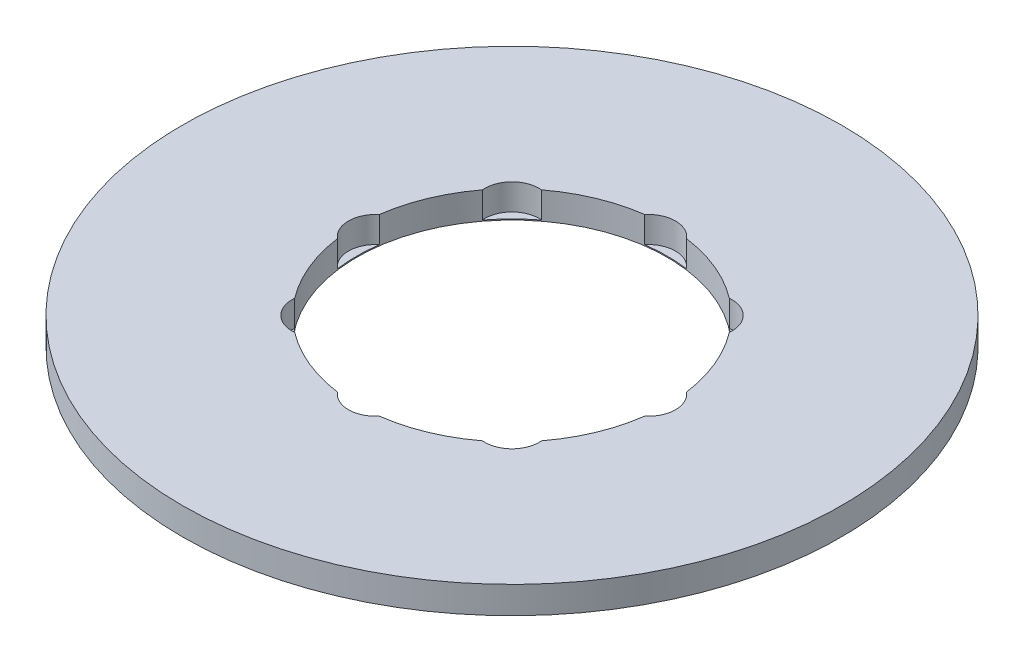
ISO-10303-21;
HEADER;
FILE_DESCRIPTION(('STEP AP214'),'2;1');
FILE_NAME('part.step','',(''),(''),'','','');
FILE_SCHEMA(('AUTOMOTIVE_DESIGN { 1 0 10303 214 1 1 1 1 }'));
ENDSEC;
DATA;
#1=APPLICATION_CONTEXT('core data for automotive mechanical design processes');
#2=APPLICATION_PROTOCOL_DEFINITION('international standard','automotive_design',2000,#1);
#3=PRODUCT_CONTEXT('',#1,'mechanical');
#4=PRODUCT('Part','Part','',(#3));
#5=PRODUCT_RELATED_PRODUCT_CATEGORY('part','',(#4));
#6=PRODUCT_DEFINITION_FORMATION('','',#4);
#7=PRODUCT_DEFINITION_CONTEXT('part definition',#1,'design');
#8=PRODUCT_DEFINITION('design','',#6,#7);
#9=PRODUCT_DEFINITION_SHAPE('','',#8);
#10=(LENGTH_UNIT() NAMED_UNIT(*) SI_UNIT(.MILLI.,.METRE.));
#11=(NAMED_UNIT(*) PLANE_ANGLE_UNIT() SI_UNIT($,.RADIAN.));
#12=(NAMED_UNIT(*) SI_UNIT($,.STERADIAN.) SOLID_ANGLE_UNIT());
#13=UNCERTAINTY_MEASURE_WITH_UNIT(LENGTH_MEASURE(1.E-05),#10,'distance_accuracy_value','');
#14=(GEOMETRIC_REPRESENTATION_CONTEXT(3) GLOBAL_UNCERTAINTY_ASSIGNED_CONTEXT((#13)) GLOBAL_UNIT_ASSIGNED_CONTEXT((#10,
#11,#12)) REPRESENTATION_CONTEXT('',''));
#15=CARTESIAN_POINT('',(0.,0.,0.));
#16=DIRECTION('',(0.,0.,1.));
#17=DIRECTION('',(1.,0.,0.));
#18=AXIS2_PLACEMENT_3D('',#15,#16,#17);
#19=CARTESIAN_POINT('',(0.,7.,0.));
#20=DIRECTION('',(0.,-1.,0.));
#21=DIRECTION('',(0.,0.,-1.));
#22=AXIS2_PLACEMENT_3D('',#19,#20,#21);
#23=CYLINDRICAL_SURFACE('',#22,85.);
#24=CARTESIAN_POINT('',(0.,7.,0.));
#25=DIRECTION('',(0.,1.,0.));
#26=DIRECTION('',(0.,0.,1.));
#27=AXIS2_PLACEMENT_3D('',#24,#25,#26);
#28=CIRCLE('',#27,85.);
#29=CARTESIAN_POINT('',(0.,7.,85.));
#30=VERTEX_POINT('',#29);
#31=EDGE_CURVE('E183',#30,#30,#28,.T.);
#32=ORIENTED_EDGE('',*,*,#31,.F.);
#33=EDGE_LOOP('',(#32));
#34=FACE_BOUND('',#33,.T.);
#35=CARTESIAN_POINT('',(0.,0.,0.));
#36=DIRECTION('',(0.,1.,0.));
#37=DIRECTION('',(0.,0.,1.));
#38=AXIS2_PLACEMENT_3D('',#35,#36,#37);
#39=CIRCLE('',#38,85.);
#40=CARTESIAN_POINT('',(0.,0.,85.));
#41=VERTEX_POINT('',#40);
#42=EDGE_CURVE('E182',#41,#41,#39,.T.);
#43=ORIENTED_EDGE('',*,*,#42,.T.);
#44=EDGE_LOOP('',(#43));
#45=FACE_BOUND('',#44,.T.);
#46=ADVANCED_FACE('F39',(#34,#45),#23,.T.);
#47=CARTESIAN_POINT('',(0.,7.,0.));
#48=DIRECTION('',(0.,1.,0.));
#49=DIRECTION('',(0.,0.,1.));
#50=AXIS2_PLACEMENT_3D('',#47,#48,#49);
#51=PLANE('',#50);
#52=CARTESIAN_POINT('',(1.22781829028546E-13,7.,35.166113495319));
#53=DIRECTION('',(0.,1.,0.));
#54=DIRECTION('',(1.,0.,0.));
#55=AXIS2_PLACEMENT_3D('',#52,#53,#54);
#56=CIRCLE('',#55,7.00584314260088);
#57=CARTESIAN_POINT('',(-5.39597048317015,7.,39.6343727406497));
#58=VERTEX_POINT('',#57);
#59=CARTESIAN_POINT('',(5.39597048317043,7.,39.6343727406497));
#60=VERTEX_POINT('',#59);
#61=EDGE_CURVE('E256',#58,#60,#56,.T.);
#62=ORIENTED_EDGE('',*,*,#61,.F.);
#63=CARTESIAN_POINT('',(0.,7.,0.));
#64=DIRECTION('',(0.,1.,0.));
#65=DIRECTION('',(0.,0.,1.));
#66=AXIS2_PLACEMENT_3D('',#63,#64,#65);
#67=CIRCLE('',#66,40.);
#68=CARTESIAN_POINT('',(-24.2102064132564,7.,31.8412610527209));
#69=VERTEX_POINT('',#68);
#70=EDGE_CURVE('E175',#69,#58,#67,.T.);
#71=ORIENTED_EDGE('',*,*,#70,.F.);
#72=CARTESIAN_POINT('',(-24.8661973205158,7.,24.8661973205159));
#73=DIRECTION('',(0.,1.,0.));
#74=DIRECTION('',(0.707106781186549,0.,0.707106781186546));
#75=AXIS2_PLACEMENT_3D('',#72,#73,#74);
#76=CIRCLE('',#75,7.00584314260088);
#77=CARTESIAN_POINT('',(-31.8412610527208,7.,24.2102064132565));
#78=VERTEX_POINT('',#77);
#79=EDGE_CURVE('E152',#78,#69,#76,.T.);
#80=ORIENTED_EDGE('',*,*,#79,.F.);
#81=CARTESIAN_POINT('',(-39.6343727406497,7.,5.39597048317029));
#82=VERTEX_POINT('',#81);
#83=EDGE_CURVE('E168',#82,#78,#67,.T.);
#84=ORIENTED_EDGE('',*,*,#83,.F.);
#85=CARTESIAN_POINT('',(-35.166113495319,7.,0.));
#86=DIRECTION('',(0.,1.,0.));
#87=DIRECTION('',(0.,0.,1.));
#88=AXIS2_PLACEMENT_3D('',#85,#86,#87);
#89=CIRCLE('',#88,7.00584314260088);
#90=CARTESIAN_POINT('',(-39.6343727406497,7.,-5.39597048317029));
#91=VERTEX_POINT('',#90);
#92=EDGE_CURVE('E205',#91,#82,#89,.T.);
#93=ORIENTED_EDGE('',*,*,#92,.F.);
#94=CARTESIAN_POINT('',(-31.8412610527211,7.,-24.2102064132561));
#95=VERTEX_POINT('',#94);
#96=EDGE_CURVE('E181',#95,#91,#67,.T.);
#97=ORIENTED_EDGE('',*,*,#96,.F.);
#98=CARTESIAN_POINT('',(-24.8661973205162,7.,-24.8661973205156));
#99=DIRECTION('',(0.,1.,0.));
#100=DIRECTION('',(-0.707106781186539,0.,0.707106781186556));
#101=AXIS2_PLACEMENT_3D('',#98,#99,#100);
#102=CIRCLE('',#101,7.00584314260088);
#103=CARTESIAN_POINT('',(-24.2102064132569,7.,-31.8412610527205));
#104=VERTEX_POINT('',#103);
#105=EDGE_CURVE('E453',#104,#95,#102,.T.);
#106=ORIENTED_EDGE('',*,*,#105,.F.);
#107=CARTESIAN_POINT('',(-5.3959704831707,7.,-39.6343727406496));
#108=VERTEX_POINT('',#107);
#109=EDGE_CURVE('E189',#108,#104,#67,.T.);
#110=ORIENTED_EDGE('',*,*,#109,.F.);
#111=CARTESIAN_POINT('',(-3.68345487085638E-13,7.,-35.166113495319));
#112=DIRECTION('',(0.,1.,0.));
#113=DIRECTION('',(-1.,0.,0.));
#114=AXIS2_PLACEMENT_3D('',#111,#112,#113);
#115=CIRCLE('',#114,7.00584314260088);
#116=CARTESIAN_POINT('',(5.39597048316987,7.,-39.6343727406497));
#117=VERTEX_POINT('',#116);
#118=EDGE_CURVE('E462',#117,#108,#115,.T.);
#119=ORIENTED_EDGE('',*,*,#118,.F.);
#120=CARTESIAN_POINT('',(24.2102064132562,7.,-31.841261052721));
#121=VERTEX_POINT('',#120);
#122=EDGE_CURVE('E197',#121,#117,#67,.T.);
#123=ORIENTED_EDGE('',*,*,#122,.F.);
#124=CARTESIAN_POINT('',(24.8661973205156,7.,-24.8661973205161));
#125=DIRECTION('',(0.,1.,0.));
#126=DIRECTION('',(-0.707106781186554,0.,-0.707106781186541));
#127=AXIS2_PLACEMENT_3D('',#124,#125,#126);
#128=CIRCLE('',#127,7.00584314260088);
#129=CARTESIAN_POINT('',(31.8412610527206,7.,-24.2102064132568));
#130=VERTEX_POINT('',#129);
#131=EDGE_CURVE('E470',#130,#121,#128,.T.);
#132=ORIENTED_EDGE('',*,*,#131,.F.);
#133=CARTESIAN_POINT('',(39.6343727406497,7.,-5.39597048317029));
#134=VERTEX_POINT('',#133);
#135=EDGE_CURVE('E489',#134,#130,#67,.T.);
#136=ORIENTED_EDGE('',*,*,#135,.F.);
#137=CARTESIAN_POINT('',(35.166113495319,7.,0.));
#138=DIRECTION('',(0.,1.,0.));
#139=DIRECTION('',(0.,0.,-1.));
#140=AXIS2_PLACEMENT_3D('',#137,#138,#139);
#141=CIRCLE('',#140,7.00584314260088);
#142=CARTESIAN_POINT('',(39.6343727406497,7.,5.39597048317029));
#143=VERTEX_POINT('',#142);
#144=EDGE_CURVE('E476',#143,#134,#141,.T.);
#145=ORIENTED_EDGE('',*,*,#144,.F.);
#146=CARTESIAN_POINT('',(31.8412610527209,7.,24.2102064132563));
#147=VERTEX_POINT('',#146);
#148=EDGE_CURVE('E491',#147,#143,#67,.T.);
#149=ORIENTED_EDGE('',*,*,#148,.F.);
#150=CARTESIAN_POINT('',(24.866197320516,7.,24.8661973205157));
#151=DIRECTION('',(0.,1.,0.));
#152=DIRECTION('',(0.707106781186544,0.,-0.707106781186551));
#153=AXIS2_PLACEMENT_3D('',#150,#151,#152);
#154=CIRCLE('',#153,7.00584314260088);
#155=CARTESIAN_POINT('',(24.2102064132566,7.,31.8412610527207));
#156=VERTEX_POINT('',#155);
#157=EDGE_CURVE('E475',#156,#147,#154,.T.);
#158=ORIENTED_EDGE('',*,*,#157,.F.);
#159=EDGE_CURVE('E190',#60,#156,#67,.T.);
#160=ORIENTED_EDGE('',*,*,#159,.F.);
#161=EDGE_LOOP('',(#62,#71,#80,#84,#93,#97,#106,#110,#119,#123,#132,#136,#145,#149,#158,#160));
#162=FACE_BOUND('',#161,.T.);
#163=ORIENTED_EDGE('',*,*,#31,.T.);
#164=EDGE_LOOP('',(#163));
#165=FACE_BOUND('',#164,.T.);
#166=ADVANCED_FACE('F170',(#162,#165),#51,.T.);
#167=CARTESIAN_POINT('',(0.,0.,0.));
#168=DIRECTION('',(0.,1.,0.));
#169=DIRECTION('',(0.,0.,1.));
#170=AXIS2_PLACEMENT_3D('',#167,#168,#169);
#171=PLANE('',#170);
#172=CARTESIAN_POINT('',(0.,0.,0.));
#173=DIRECTION('',(0.,1.,0.));
#174=DIRECTION('',(0.,0.,1.));
#175=AXIS2_PLACEMENT_3D('',#172,#173,#174);
#176=CIRCLE('',#175,40.);
#177=CARTESIAN_POINT('',(0.,0.,40.));
#178=VERTEX_POINT('',#177);
#179=EDGE_CURVE('E191',#178,#178,#176,.T.);
#180=ORIENTED_EDGE('',*,*,#179,.T.);
#181=EDGE_LOOP('',(#180));
#182=FACE_BOUND('',#181,.T.);
#183=ORIENTED_EDGE('',*,*,#42,.F.);
#184=EDGE_LOOP('',(#183));
#185=FACE_BOUND('',#184,.T.);
#186=ADVANCED_FACE('F277',(#182,#185),#171,.F.);
#187=CARTESIAN_POINT('',(0.,7.,0.));
#188=DIRECTION('',(0.,-1.,0.));
#189=DIRECTION('',(0.,0.,-1.));
#190=AXIS2_PLACEMENT_3D('',#187,#188,#189);
#191=CYLINDRICAL_SURFACE('',#190,40.);
#192=DIRECTION('',(0.,1.,0.));
#193=VECTOR('',#192,1.);
#194=CARTESIAN_POINT('',(-5.39597048317015,3.63539251984603,39.6343727406497));
#195=LINE('',#194,#193);
#196=CARTESIAN_POINT('',(-5.39597048317015,0.270785039692067,39.6343727406497));
#197=VERTEX_POINT('',#196);
#198=EDGE_CURVE('E11',#197,#58,#195,.T.);
#199=ORIENTED_EDGE('',*,*,#198,.F.);
#200=CARTESIAN_POINT('',(0.,0.270785039692067,0.));
#201=DIRECTION('',(0.,1.,0.));
#202=DIRECTION('',(0.,0.,1.));
#203=AXIS2_PLACEMENT_3D('',#200,#201,#202);
#204=CIRCLE('',#203,40.);
#205=CARTESIAN_POINT('',(5.39597048317043,0.270785039692067,39.6343727406497));
#206=VERTEX_POINT('',#205);
#207=EDGE_CURVE('E251',#197,#206,#204,.T.);
#208=ORIENTED_EDGE('',*,*,#207,.T.);
#209=DIRECTION('',(0.,1.,0.));
#210=VECTOR('',#209,1.);
#211=CARTESIAN_POINT('',(5.39597048317043,3.63539251984603,39.6343727406497));
#212=LINE('',#211,#210);
#213=EDGE_CURVE('E46',#60,#206,#212,.F.);
#214=ORIENTED_EDGE('',*,*,#213,.F.);
#215=ORIENTED_EDGE('',*,*,#159,.T.);
#216=DIRECTION('',(0.,1.,0.));
#217=VECTOR('',#216,1.);
#218=CARTESIAN_POINT('',(24.2102064132566,3.63539251984603,31.8412610527207));
#219=LINE('',#218,#217);
#220=CARTESIAN_POINT('',(24.2102064132566,0.270785039692067,31.8412610527207));
#221=VERTEX_POINT('',#220);
#222=EDGE_CURVE('E253',#221,#156,#219,.T.);
#223=ORIENTED_EDGE('',*,*,#222,.F.);
#224=CARTESIAN_POINT('',(0.,0.270785039692067,0.));
#225=DIRECTION('',(0.,1.,0.));
#226=DIRECTION('',(0.,0.,1.));
#227=AXIS2_PLACEMENT_3D('',#224,#225,#226);
#228=CIRCLE('',#227,40.);
#229=CARTESIAN_POINT('',(31.8412610527209,0.270785039692067,24.2102064132563));
#230=VERTEX_POINT('',#229);
#231=EDGE_CURVE('E246',#221,#230,#228,.T.);
#232=ORIENTED_EDGE('',*,*,#231,.T.);
#233=DIRECTION('',(0.,1.,0.));
#234=VECTOR('',#233,1.);
#235=CARTESIAN_POINT('',(31.8412610527209,3.63539251984603,24.2102064132563));
#236=LINE('',#235,#234);
#237=EDGE_CURVE('E248',#147,#230,#236,.F.);
#238=ORIENTED_EDGE('',*,*,#237,.F.);
#239=ORIENTED_EDGE('',*,*,#148,.T.);
#240=DIRECTION('',(0.,1.,0.));
#241=VECTOR('',#240,1.);
#242=CARTESIAN_POINT('',(39.6343727406497,3.63539251984603,5.39597048317029));
#243=LINE('',#242,#241);
#244=CARTESIAN_POINT('',(39.6343727406497,0.270785039692067,5.39597048317029));
#245=VERTEX_POINT('',#244);
#246=EDGE_CURVE('E243',#245,#143,#243,.T.);
#247=ORIENTED_EDGE('',*,*,#246,.F.);
#248=CARTESIAN_POINT('',(0.,0.270785039692067,0.));
#249=DIRECTION('',(0.,1.,0.));
#250=DIRECTION('',(0.,0.,1.));
#251=AXIS2_PLACEMENT_3D('',#248,#249,#250);
#252=CIRCLE('',#251,40.);
#253=CARTESIAN_POINT('',(39.6343727406497,0.270785039692067,-5.39597048317029));
#254=VERTEX_POINT('',#253);
#255=EDGE_CURVE('E236',#245,#254,#252,.T.);
#256=ORIENTED_EDGE('',*,*,#255,.T.);
#257=DIRECTION('',(0.,1.,0.));
#258=VECTOR('',#257,1.);
#259=CARTESIAN_POINT('',(39.6343727406497,3.63539251984603,-5.39597048317029));
#260=LINE('',#259,#258);
#261=EDGE_CURVE('E241',#134,#254,#260,.F.);
#262=ORIENTED_EDGE('',*,*,#261,.F.);
#263=ORIENTED_EDGE('',*,*,#135,.T.);
#264=DIRECTION('',(0.,1.,0.));
#265=VECTOR('',#264,1.);
#266=CARTESIAN_POINT('',(31.8412610527206,3.63539251984603,-24.2102064132568));
#267=LINE('',#266,#265);
#268=CARTESIAN_POINT('',(31.8412610527206,0.270785039692067,-24.2102064132568));
#269=VERTEX_POINT('',#268);
#270=EDGE_CURVE('E237',#269,#130,#267,.T.);
#271=ORIENTED_EDGE('',*,*,#270,.F.);
#272=CARTESIAN_POINT('',(0.,0.270785039692067,0.));
#273=DIRECTION('',(0.,1.,0.));
#274=DIRECTION('',(0.,0.,1.));
#275=AXIS2_PLACEMENT_3D('',#272,#273,#274);
#276=CIRCLE('',#275,40.);
#277=CARTESIAN_POINT('',(24.2102064132562,0.270785039692067,-31.841261052721));
#278=VERTEX_POINT('',#277);
#279=EDGE_CURVE('E229',#269,#278,#276,.T.);
#280=ORIENTED_EDGE('',*,*,#279,.T.);
#281=DIRECTION('',(0.,1.,0.));
#282=VECTOR('',#281,1.);
#283=CARTESIAN_POINT('',(24.2102064132562,3.63539251984603,-31.841261052721));
#284=LINE('',#283,#282);
#285=EDGE_CURVE('E232',#121,#278,#284,.F.);
#286=ORIENTED_EDGE('',*,*,#285,.F.);
#287=ORIENTED_EDGE('',*,*,#122,.T.);
#288=DIRECTION('',(0.,1.,0.));
#289=VECTOR('',#288,1.);
#290=CARTESIAN_POINT('',(5.39597048316987,3.63539251984603,-39.6343727406497));
#291=LINE('',#290,#289);
#292=CARTESIAN_POINT('',(5.39597048316987,0.270785039692067,-39.6343727406497));
#293=VERTEX_POINT('',#292);
#294=EDGE_CURVE('E227',#293,#117,#291,.T.);
#295=ORIENTED_EDGE('',*,*,#294,.F.);
#296=CARTESIAN_POINT('',(0.,0.270785039692067,0.));
#297=DIRECTION('',(0.,1.,0.));
#298=DIRECTION('',(0.,0.,1.));
#299=AXIS2_PLACEMENT_3D('',#296,#297,#298);
#300=CIRCLE('',#299,40.);
#301=CARTESIAN_POINT('',(-5.3959704831707,0.270785039692067,-39.6343727406496));
#302=VERTEX_POINT('',#301);
#303=EDGE_CURVE('E225',#293,#302,#300,.T.);
#304=ORIENTED_EDGE('',*,*,#303,.T.);
#305=DIRECTION('',(0.,1.,0.));
#306=VECTOR('',#305,1.);
#307=CARTESIAN_POINT('',(-5.3959704831707,3.63539251984603,-39.6343727406496));
#308=LINE('',#307,#306);
#309=EDGE_CURVE('E223',#108,#302,#308,.F.);
#310=ORIENTED_EDGE('',*,*,#309,.F.);
#311=ORIENTED_EDGE('',*,*,#109,.T.);
#312=DIRECTION('',(0.,1.,0.));
#313=VECTOR('',#312,1.);
#314=CARTESIAN_POINT('',(-24.2102064132569,3.63539251984603,-31.8412610527205));
#315=LINE('',#314,#313);
#316=CARTESIAN_POINT('',(-24.2102064132569,0.270785039692067,-31.8412610527205));
#317=VERTEX_POINT('',#316);
#318=EDGE_CURVE('E219',#317,#104,#315,.T.);
#319=ORIENTED_EDGE('',*,*,#318,.F.);
#320=CARTESIAN_POINT('',(0.,0.270785039692067,0.));
#321=DIRECTION('',(0.,1.,0.));
#322=DIRECTION('',(0.,0.,1.));
#323=AXIS2_PLACEMENT_3D('',#320,#321,#322);
#324=CIRCLE('',#323,40.);
#325=CARTESIAN_POINT('',(-31.8412610527211,0.270785039692067,-24.2102064132561));
#326=VERTEX_POINT('',#325);
#327=EDGE_CURVE('E159',#317,#326,#324,.T.);
#328=ORIENTED_EDGE('',*,*,#327,.T.);
#329=DIRECTION('',(0.,1.,0.));
#330=VECTOR('',#329,1.);
#331=CARTESIAN_POINT('',(-31.8412610527211,3.63539251984603,-24.2102064132561));
#332=LINE('',#331,#330);
#333=EDGE_CURVE('E220',#95,#326,#332,.F.);
#334=ORIENTED_EDGE('',*,*,#333,.F.);
#335=ORIENTED_EDGE('',*,*,#96,.T.);
#336=DIRECTION('',(0.,1.,0.));
#337=VECTOR('',#336,1.);
#338=CARTESIAN_POINT('',(-39.6343727406497,3.63539251984603,-5.39597048317029));
#339=LINE('',#338,#337);
#340=CARTESIAN_POINT('',(-39.6343727406497,0.270785039692067,-5.39597048317029));
#341=VERTEX_POINT('',#340);
#342=EDGE_CURVE('E209',#341,#91,#339,.T.);
#343=ORIENTED_EDGE('',*,*,#342,.F.);
#344=CARTESIAN_POINT('',(0.,0.270785039692067,0.));
#345=DIRECTION('',(0.,1.,0.));
#346=DIRECTION('',(0.,0.,1.));
#347=AXIS2_PLACEMENT_3D('',#344,#345,#346);
#348=CIRCLE('',#347,40.);
#349=CARTESIAN_POINT('',(-39.6343727406497,0.270785039692067,5.39597048317029));
#350=VERTEX_POINT('',#349);
#351=EDGE_CURVE('E206',#341,#350,#348,.T.);
#352=ORIENTED_EDGE('',*,*,#351,.T.);
#353=DIRECTION('',(0.,1.,0.));
#354=VECTOR('',#353,1.);
#355=CARTESIAN_POINT('',(-39.6343727406497,3.63539251984603,5.39597048317029));
#356=LINE('',#355,#354);
#357=EDGE_CURVE('E179',#82,#350,#356,.F.);
#358=ORIENTED_EDGE('',*,*,#357,.F.);
#359=ORIENTED_EDGE('',*,*,#83,.T.);
#360=DIRECTION('',(0.,1.,0.));
#361=VECTOR('',#360,1.);
#362=CARTESIAN_POINT('',(-31.8412610527208,3.63539251984603,24.2102064132565));
#363=LINE('',#362,#361);
#364=CARTESIAN_POINT('',(-31.8412610527208,0.270785039692067,24.2102064132565));
#365=VERTEX_POINT('',#364);
#366=EDGE_CURVE('E147',#365,#78,#363,.T.);
#367=ORIENTED_EDGE('',*,*,#366,.F.);
#368=CARTESIAN_POINT('',(0.,0.270785039692067,0.));
#369=DIRECTION('',(0.,1.,0.));
#370=DIRECTION('',(0.,0.,1.));
#371=AXIS2_PLACEMENT_3D('',#368,#369,#370);
#372=CIRCLE('',#371,40.);
#373=CARTESIAN_POINT('',(-24.2102064132564,0.270785039692067,31.8412610527209));
#374=VERTEX_POINT('',#373);
#375=EDGE_CURVE('E215',#365,#374,#372,.T.);
#376=ORIENTED_EDGE('',*,*,#375,.T.);
#377=DIRECTION('',(0.,1.,0.));
#378=VECTOR('',#377,1.);
#379=CARTESIAN_POINT('',(-24.2102064132564,3.63539251984603,31.8412610527209));
#380=LINE('',#379,#378);
#381=EDGE_CURVE('E161',#69,#374,#380,.F.);
#382=ORIENTED_EDGE('',*,*,#381,.F.);
#383=ORIENTED_EDGE('',*,*,#70,.T.);
#384=EDGE_LOOP('',(#199,#208,#214,#215,#223,#232,#238,#239,#247,#256,#262,#263,#271,#280,#286,
#287,#295,#304,#310,#311,#319,#328,#334,#335,#343,#352,#358,#359,#367,#376,#382,#383));
#385=FACE_BOUND('',#384,.T.);
#386=ORIENTED_EDGE('',*,*,#179,.F.);
#387=EDGE_LOOP('',(#386));
#388=FACE_BOUND('',#387,.T.);
#389=ADVANCED_FACE('F176',(#385,#388),#191,.F.);
#390=CARTESIAN_POINT('',(-35.166113495319,0.270785039692067,0.));
#391=DIRECTION('',(0.,1.,0.));
#392=DIRECTION('',(0.,0.,1.));
#393=AXIS2_PLACEMENT_3D('',#390,#391,#392);
#394=CYLINDRICAL_SURFACE('',#393,7.00584314260088);
#395=ORIENTED_EDGE('',*,*,#342,.T.);
#396=ORIENTED_EDGE('',*,*,#92,.T.);
#397=ORIENTED_EDGE('',*,*,#357,.T.);
#398=CARTESIAN_POINT('',(-35.166113495319,0.270785039692067,0.));
#399=DIRECTION('',(0.,1.,0.));
#400=DIRECTION('',(0.,0.,1.));
#401=AXIS2_PLACEMENT_3D('',#398,#399,#400);
#402=CIRCLE('',#401,7.00584314260088);
#403=EDGE_CURVE('E200',#341,#350,#402,.T.);
#404=ORIENTED_EDGE('',*,*,#403,.F.);
#405=EDGE_LOOP('',(#395,#396,#397,#404));
#406=FACE_BOUND('',#405,.T.);
#407=ADVANCED_FACE('F286',(#406),#394,.F.);
#408=CARTESIAN_POINT('',(-35.166113495319,0.270785039692067,0.));
#409=DIRECTION('',(0.,1.,0.));
#410=DIRECTION('',(0.,0.,1.));
#411=AXIS2_PLACEMENT_3D('',#408,#409,#410);
#412=PLANE('',#411);
#413=ORIENTED_EDGE('',*,*,#403,.T.);
#414=ORIENTED_EDGE('',*,*,#351,.F.);
#415=EDGE_LOOP('',(#413,#414));
#416=FACE_BOUND('',#415,.T.);
#417=ADVANCED_FACE('F289',(#416),#412,.T.);
#418=CARTESIAN_POINT('',(-24.8661973205158,0.270785039692067,24.8661973205159));
#419=DIRECTION('',(0.,1.,0.));
#420=DIRECTION('',(0.,0.,1.));
#421=AXIS2_PLACEMENT_3D('',#418,#419,#420);
#422=CYLINDRICAL_SURFACE('',#421,7.00584314260088);
#423=ORIENTED_EDGE('',*,*,#366,.T.);
#424=ORIENTED_EDGE('',*,*,#79,.T.);
#425=ORIENTED_EDGE('',*,*,#381,.T.);
#426=CARTESIAN_POINT('',(-24.8661973205158,0.270785039692067,24.8661973205159));
#427=DIRECTION('',(0.,1.,0.));
#428=DIRECTION('',(0.707106781186549,0.,0.707106781186546));
#429=AXIS2_PLACEMENT_3D('',#426,#427,#428);
#430=CIRCLE('',#429,7.00584314260088);
#431=EDGE_CURVE('E156',#365,#374,#430,.T.);
#432=ORIENTED_EDGE('',*,*,#431,.F.);
#433=EDGE_LOOP('',(#423,#424,#425,#432));
#434=FACE_BOUND('',#433,.T.);
#435=ADVANCED_FACE('F155',(#434),#422,.F.);
#436=CARTESIAN_POINT('',(-24.8661973205158,0.270785039692067,24.8661973205159));
#437=DIRECTION('',(0.,1.,0.));
#438=DIRECTION('',(0.707106781186549,0.,0.707106781186546));
#439=AXIS2_PLACEMENT_3D('',#436,#437,#438);
#440=PLANE('',#439);
#441=ORIENTED_EDGE('',*,*,#431,.T.);
#442=ORIENTED_EDGE('',*,*,#375,.F.);
#443=EDGE_LOOP('',(#441,#442));
#444=FACE_BOUND('',#443,.T.);
#445=ADVANCED_FACE('F300',(#444),#440,.T.);
#446=CARTESIAN_POINT('',(-24.8661973205162,0.270785039692067,-24.8661973205156));
#447=DIRECTION('',(0.,1.,0.));
#448=DIRECTION('',(0.,0.,1.));
#449=AXIS2_PLACEMENT_3D('',#446,#447,#448);
#450=CYLINDRICAL_SURFACE('',#449,7.00584314260088);
#451=ORIENTED_EDGE('',*,*,#318,.T.);
#452=ORIENTED_EDGE('',*,*,#105,.T.);
#453=ORIENTED_EDGE('',*,*,#333,.T.);
#454=CARTESIAN_POINT('',(-24.8661973205162,0.270785039692067,-24.8661973205156));
#455=DIRECTION('',(0.,1.,0.));
#456=DIRECTION('',(-0.707106781186539,0.,0.707106781186556));
#457=AXIS2_PLACEMENT_3D('',#454,#455,#456);
#458=CIRCLE('',#457,7.00584314260088);
#459=EDGE_CURVE('E454',#317,#326,#458,.T.);
#460=ORIENTED_EDGE('',*,*,#459,.F.);
#461=EDGE_LOOP('',(#451,#452,#453,#460));
#462=FACE_BOUND('',#461,.T.);
#463=ADVANCED_FACE('F299',(#462),#450,.F.);
#464=CARTESIAN_POINT('',(-24.8661973205162,0.270785039692067,-24.8661973205156));
#465=DIRECTION('',(0.,1.,0.));
#466=DIRECTION('',(-0.707106781186539,0.,0.707106781186556));
#467=AXIS2_PLACEMENT_3D('',#464,#465,#466);
#468=PLANE('',#467);
#469=ORIENTED_EDGE('',*,*,#459,.T.);
#470=ORIENTED_EDGE('',*,*,#327,.F.);
#471=EDGE_LOOP('',(#469,#470));
#472=FACE_BOUND('',#471,.T.);
#473=ADVANCED_FACE('F379',(#472),#468,.T.);
#474=CARTESIAN_POINT('',(-3.68345487085638E-13,0.270785039692067,-35.166113495319));
#475=DIRECTION('',(0.,1.,0.));
#476=DIRECTION('',(0.,0.,1.));
#477=AXIS2_PLACEMENT_3D('',#474,#475,#476);
#478=CYLINDRICAL_SURFACE('',#477,7.00584314260088);
#479=ORIENTED_EDGE('',*,*,#294,.T.);
#480=ORIENTED_EDGE('',*,*,#118,.T.);
#481=ORIENTED_EDGE('',*,*,#309,.T.);
#482=CARTESIAN_POINT('',(-3.68345487085638E-13,0.270785039692067,-35.166113495319));
#483=DIRECTION('',(0.,1.,0.));
#484=DIRECTION('',(-1.,0.,0.));
#485=AXIS2_PLACEMENT_3D('',#482,#483,#484);
#486=CIRCLE('',#485,7.00584314260088);
#487=EDGE_CURVE('E465',#293,#302,#486,.T.);
#488=ORIENTED_EDGE('',*,*,#487,.F.);
#489=EDGE_LOOP('',(#479,#480,#481,#488));
#490=FACE_BOUND('',#489,.T.);
#491=ADVANCED_FACE('F371',(#490),#478,.F.);
#492=CARTESIAN_POINT('',(-3.68345487085638E-13,0.270785039692067,-35.166113495319));
#493=DIRECTION('',(0.,1.,0.));
#494=DIRECTION('',(-1.,0.,0.));
#495=AXIS2_PLACEMENT_3D('',#492,#493,#494);
#496=PLANE('',#495);
#497=ORIENTED_EDGE('',*,*,#487,.T.);
#498=ORIENTED_EDGE('',*,*,#303,.F.);
#499=EDGE_LOOP('',(#497,#498));
#500=FACE_BOUND('',#499,.T.);
#501=ADVANCED_FACE('F308',(#500),#496,.T.);
#502=CARTESIAN_POINT('',(24.8661973205156,0.270785039692067,-24.8661973205161));
#503=DIRECTION('',(0.,1.,0.));
#504=DIRECTION('',(0.,0.,1.));
#505=AXIS2_PLACEMENT_3D('',#502,#503,#504);
#506=CYLINDRICAL_SURFACE('',#505,7.00584314260088);
#507=ORIENTED_EDGE('',*,*,#270,.T.);
#508=ORIENTED_EDGE('',*,*,#131,.T.);
#509=ORIENTED_EDGE('',*,*,#285,.T.);
#510=CARTESIAN_POINT('',(24.8661973205156,0.270785039692067,-24.8661973205161));
#511=DIRECTION('',(0.,1.,0.));
#512=DIRECTION('',(-0.707106781186554,0.,-0.707106781186541));
#513=AXIS2_PLACEMENT_3D('',#510,#511,#512);
#514=CIRCLE('',#513,7.00584314260088);
#515=EDGE_CURVE('E477',#269,#278,#514,.T.);
#516=ORIENTED_EDGE('',*,*,#515,.F.);
#517=EDGE_LOOP('',(#507,#508,#509,#516));
#518=FACE_BOUND('',#517,.T.);
#519=ADVANCED_FACE('F305',(#518),#506,.F.);
#520=CARTESIAN_POINT('',(24.8661973205156,0.270785039692067,-24.8661973205161));
#521=DIRECTION('',(0.,1.,0.));
#522=DIRECTION('',(-0.707106781186554,0.,-0.707106781186541));
#523=AXIS2_PLACEMENT_3D('',#520,#521,#522);
#524=PLANE('',#523);
#525=ORIENTED_EDGE('',*,*,#515,.T.);
#526=ORIENTED_EDGE('',*,*,#279,.F.);
#527=EDGE_LOOP('',(#525,#526));
#528=FACE_BOUND('',#527,.T.);
#529=ADVANCED_FACE('F304',(#528),#524,.T.);
#530=CARTESIAN_POINT('',(35.166113495319,0.270785039692067,0.));
#531=DIRECTION('',(0.,1.,0.));
#532=DIRECTION('',(0.,0.,1.));
#533=AXIS2_PLACEMENT_3D('',#530,#531,#532);
#534=CYLINDRICAL_SURFACE('',#533,7.00584314260088);
#535=ORIENTED_EDGE('',*,*,#246,.T.);
#536=ORIENTED_EDGE('',*,*,#144,.T.);
#537=ORIENTED_EDGE('',*,*,#261,.T.);
#538=CARTESIAN_POINT('',(35.166113495319,0.270785039692067,0.));
#539=DIRECTION('',(0.,1.,0.));
#540=DIRECTION('',(0.,0.,-1.));
#541=AXIS2_PLACEMENT_3D('',#538,#539,#540);
#542=CIRCLE('',#541,7.00584314260088);
#543=EDGE_CURVE('E478',#245,#254,#542,.T.);
#544=ORIENTED_EDGE('',*,*,#543,.F.);
#545=EDGE_LOOP('',(#535,#536,#537,#544));
#546=FACE_BOUND('',#545,.T.);
#547=ADVANCED_FACE('F309',(#546),#534,.F.);
#548=CARTESIAN_POINT('',(35.166113495319,0.270785039692067,0.));
#549=DIRECTION('',(0.,1.,0.));
#550=DIRECTION('',(0.,0.,-1.));
#551=AXIS2_PLACEMENT_3D('',#548,#549,#550);
#552=PLANE('',#551);
#553=ORIENTED_EDGE('',*,*,#543,.T.);
#554=ORIENTED_EDGE('',*,*,#255,.F.);
#555=EDGE_LOOP('',(#553,#554));
#556=FACE_BOUND('',#555,.T.);
#557=ADVANCED_FACE('F314',(#556),#552,.T.);
#558=CARTESIAN_POINT('',(24.866197320516,0.270785039692067,24.8661973205157));
#559=DIRECTION('',(0.,1.,0.));
#560=DIRECTION('',(0.,0.,1.));
#561=AXIS2_PLACEMENT_3D('',#558,#559,#560);
#562=CYLINDRICAL_SURFACE('',#561,7.00584314260088);
#563=ORIENTED_EDGE('',*,*,#222,.T.);
#564=ORIENTED_EDGE('',*,*,#157,.T.);
#565=ORIENTED_EDGE('',*,*,#237,.T.);
#566=CARTESIAN_POINT('',(24.866197320516,0.270785039692067,24.8661973205157));
#567=DIRECTION('',(0.,1.,0.));
#568=DIRECTION('',(0.707106781186544,0.,-0.707106781186551));
#569=AXIS2_PLACEMENT_3D('',#566,#567,#568);
#570=CIRCLE('',#569,7.00584314260088);
#571=EDGE_CURVE('E56',#221,#230,#570,.T.);
#572=ORIENTED_EDGE('',*,*,#571,.F.);
#573=EDGE_LOOP('',(#563,#564,#565,#572));
#574=FACE_BOUND('',#573,.T.);
#575=ADVANCED_FACE('F318',(#574),#562,.F.);
#576=CARTESIAN_POINT('',(24.866197320516,0.270785039692067,24.8661973205157));
#577=DIRECTION('',(0.,1.,0.));
#578=DIRECTION('',(0.707106781186544,0.,-0.707106781186551));
#579=AXIS2_PLACEMENT_3D('',#576,#577,#578);
#580=PLANE('',#579);
#581=ORIENTED_EDGE('',*,*,#571,.T.);
#582=ORIENTED_EDGE('',*,*,#231,.F.);
#583=EDGE_LOOP('',(#581,#582));
#584=FACE_BOUND('',#583,.T.);
#585=ADVANCED_FACE('F270',(#584),#580,.T.);
#586=CARTESIAN_POINT('',(1.22781829028546E-13,0.270785039692067,35.166113495319));
#587=DIRECTION('',(0.,1.,0.));
#588=DIRECTION('',(0.,0.,1.));
#589=AXIS2_PLACEMENT_3D('',#586,#587,#588);
#590=CYLINDRICAL_SURFACE('',#589,7.00584314260088);
#591=ORIENTED_EDGE('',*,*,#198,.T.);
#592=ORIENTED_EDGE('',*,*,#61,.T.);
#593=ORIENTED_EDGE('',*,*,#213,.T.);
#594=CARTESIAN_POINT('',(1.22781829028546E-13,0.270785039692067,35.166113495319));
#595=DIRECTION('',(0.,1.,0.));
#596=DIRECTION('',(1.,0.,0.));
#597=AXIS2_PLACEMENT_3D('',#594,#595,#596);
#598=CIRCLE('',#597,7.00584314260088);
#599=EDGE_CURVE('E55',#197,#206,#598,.T.);
#600=ORIENTED_EDGE('',*,*,#599,.F.);
#601=EDGE_LOOP('',(#591,#592,#593,#600));
#602=FACE_BOUND('',#601,.T.);
#603=ADVANCED_FACE('F260',(#602),#590,.F.);
#604=CARTESIAN_POINT('',(1.22781829028546E-13,0.270785039692067,35.166113495319));
#605=DIRECTION('',(0.,1.,0.));
#606=DIRECTION('',(1.,0.,0.));
#607=AXIS2_PLACEMENT_3D('',#604,#605,#606);
#608=PLANE('',#607);
#609=ORIENTED_EDGE('',*,*,#599,.T.);
#610=ORIENTED_EDGE('',*,*,#207,.F.);
#611=EDGE_LOOP('',(#609,#610));
#612=FACE_BOUND('',#611,.T.);
#613=ADVANCED_FACE('F261',(#612),#608,.T.);
#614=CLOSED_SHELL('',(#46,#166,#186,#389,#407,#417,#435,#445,#463,#473,#491,#501,#519,#529,#547,
#557,#575,#585,#603,#613));
#615=MANIFOLD_SOLID_BREP('B2',#614);
#616=ADVANCED_BREP_SHAPE_REPRESENTATION('',(#18,#615),#14);
#617=SHAPE_DEFINITION_REPRESENTATION(#9,#616);
ENDSEC;
END-ISO-10303-21;
